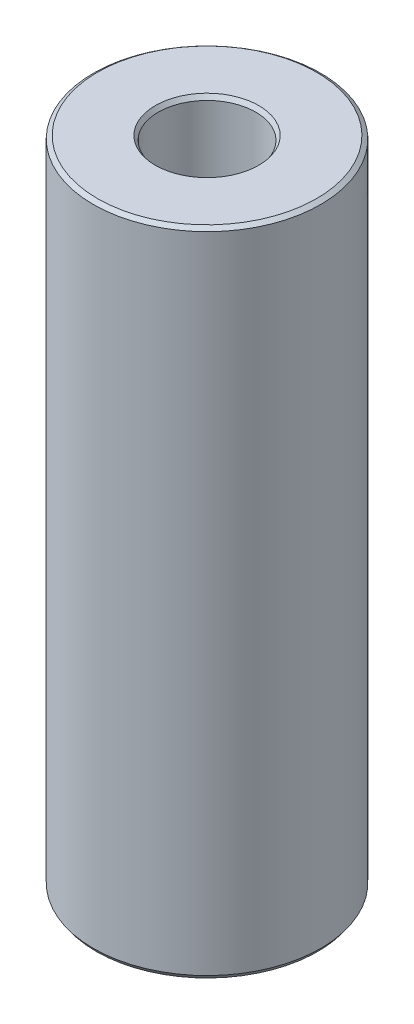
ISO-10303-21;
HEADER;
FILE_DESCRIPTION(('STEP AP214'),'2;1');
FILE_NAME('part.step','',(''),(''),'','','');
FILE_SCHEMA(('AUTOMOTIVE_DESIGN { 1 0 10303 214 1 1 1 1 }'));
ENDSEC;
DATA;
#1=APPLICATION_CONTEXT('core data for automotive mechanical design processes');
#2=APPLICATION_PROTOCOL_DEFINITION('international standard','automotive_design',2000,#1);
#3=PRODUCT_CONTEXT('',#1,'mechanical');
#4=PRODUCT('Part','Part','',(#3));
#5=PRODUCT_RELATED_PRODUCT_CATEGORY('part','',(#4));
#6=PRODUCT_DEFINITION_FORMATION('','',#4);
#7=PRODUCT_DEFINITION_CONTEXT('part definition',#1,'design');
#8=PRODUCT_DEFINITION('design','',#6,#7);
#9=PRODUCT_DEFINITION_SHAPE('','',#8);
#10=(LENGTH_UNIT() NAMED_UNIT(*) SI_UNIT(.MILLI.,.METRE.));
#11=(NAMED_UNIT(*) PLANE_ANGLE_UNIT() SI_UNIT($,.RADIAN.));
#12=(NAMED_UNIT(*) SI_UNIT($,.STERADIAN.) SOLID_ANGLE_UNIT());
#13=UNCERTAINTY_MEASURE_WITH_UNIT(LENGTH_MEASURE(1.E-05),#10,'distance_accuracy_value','');
#14=(GEOMETRIC_REPRESENTATION_CONTEXT(3) GLOBAL_UNCERTAINTY_ASSIGNED_CONTEXT((#13)) GLOBAL_UNIT_ASSIGNED_CONTEXT((#10,
#11,#12)) REPRESENTATION_CONTEXT('',''));
#15=CARTESIAN_POINT('',(0.,0.,0.));
#16=DIRECTION('',(0.,0.,1.));
#17=DIRECTION('',(1.,0.,0.));
#18=AXIS2_PLACEMENT_3D('',#15,#16,#17);
#19=CARTESIAN_POINT('',(0.,229.121744929607,0.));
#20=DIRECTION('',(0.,-1.,0.));
#21=DIRECTION('',(0.,0.,-1.));
#22=AXIS2_PLACEMENT_3D('',#19,#20,#21);
#23=CYLINDRICAL_SURFACE('',#22,40.);
#24=CARTESIAN_POINT('',(0.,1.47722546044582,0.));
#25=DIRECTION('',(0.,1.,0.));
#26=DIRECTION('',(0.,0.,1.));
#27=AXIS2_PLACEMENT_3D('',#24,#25,#26);
#28=CIRCLE('',#27,40.);
#29=CARTESIAN_POINT('',(0.,1.47722546044582,40.));
#30=VERTEX_POINT('',#29);
#31=EDGE_CURVE('E10',#30,#30,#28,.T.);
#32=ORIENTED_EDGE('',*,*,#31,.T.);
#33=EDGE_LOOP('',(#32));
#34=FACE_BOUND('',#33,.T.);
#35=CARTESIAN_POINT('',(0.,228.077412357886,0.));
#36=DIRECTION('',(0.,1.,0.));
#37=DIRECTION('',(0.,0.,1.));
#38=AXIS2_PLACEMENT_3D('',#35,#36,#37);
#39=CIRCLE('',#38,40.);
#40=CARTESIAN_POINT('',(0.,228.077412357886,40.));
#41=VERTEX_POINT('',#40);
#42=EDGE_CURVE('E50',#41,#41,#39,.F.);
#43=ORIENTED_EDGE('',*,*,#42,.T.);
#44=EDGE_LOOP('',(#43));
#45=FACE_BOUND('',#44,.T.);
#46=ADVANCED_FACE('F39',(#34,#45),#23,.T.);
#47=CARTESIAN_POINT('',(0.,229.121744929607,0.));
#48=DIRECTION('',(0.,1.,0.));
#49=DIRECTION('',(0.,0.,1.));
#50=AXIS2_PLACEMENT_3D('',#47,#48,#49);
#51=PLANE('',#50);
#52=CARTESIAN_POINT('',(0.,229.121744929607,0.));
#53=DIRECTION('',(0.,1.,0.));
#54=DIRECTION('',(0.,0.,1.));
#55=AXIS2_PLACEMENT_3D('',#52,#53,#54);
#56=CIRCLE('',#55,18.2015370441067);
#57=CARTESIAN_POINT('',(0.,229.121744929607,18.2015370441067));
#58=VERTEX_POINT('',#57);
#59=EDGE_CURVE('E58',#58,#58,#56,.F.);
#60=ORIENTED_EDGE('',*,*,#59,.T.);
#61=EDGE_LOOP('',(#60));
#62=FACE_BOUND('',#61,.T.);
#63=CARTESIAN_POINT('',(0.,229.121744929607,0.));
#64=DIRECTION('',(0.,1.,0.));
#65=DIRECTION('',(0.,0.,1.));
#66=AXIS2_PLACEMENT_3D('',#63,#64,#65);
#67=CIRCLE('',#66,38.5227745395542);
#68=CARTESIAN_POINT('',(0.,229.121744929607,38.5227745395542));
#69=VERTEX_POINT('',#68);
#70=EDGE_CURVE('E61',#69,#69,#67,.T.);
#71=ORIENTED_EDGE('',*,*,#70,.T.);
#72=EDGE_LOOP('',(#71));
#73=FACE_BOUND('',#72,.T.);
#74=ADVANCED_FACE('F88',(#62,#73),#51,.T.);
#75=CARTESIAN_POINT('',(0.,0.,0.));
#76=DIRECTION('',(0.,1.,0.));
#77=DIRECTION('',(0.,0.,1.));
#78=AXIS2_PLACEMENT_3D('',#75,#76,#77);
#79=PLANE('',#78);
#80=CARTESIAN_POINT('',(0.,0.,0.));
#81=DIRECTION('',(0.,1.,0.));
#82=DIRECTION('',(0.,0.,1.));
#83=AXIS2_PLACEMENT_3D('',#80,#81,#82);
#84=CIRCLE('',#83,18.6344299328314);
#85=CARTESIAN_POINT('',(0.,0.,18.6344299328314));
#86=VERTEX_POINT('',#85);
#87=EDGE_CURVE('E51',#86,#86,#84,.T.);
#88=ORIENTED_EDGE('',*,*,#87,.T.);
#89=EDGE_LOOP('',(#88));
#90=FACE_BOUND('',#89,.T.);
#91=CARTESIAN_POINT('',(0.,0.,0.));
#92=DIRECTION('',(0.,1.,0.));
#93=DIRECTION('',(0.,0.,1.));
#94=AXIS2_PLACEMENT_3D('',#91,#92,#93);
#95=CIRCLE('',#94,38.9556674282788);
#96=CARTESIAN_POINT('',(0.,0.,38.9556674282788));
#97=VERTEX_POINT('',#96);
#98=EDGE_CURVE('E54',#97,#97,#95,.F.);
#99=ORIENTED_EDGE('',*,*,#98,.T.);
#100=EDGE_LOOP('',(#99));
#101=FACE_BOUND('',#100,.T.);
#102=ADVANCED_FACE('F83',(#90,#101),#79,.F.);
#103=CARTESIAN_POINT('',(0.,229.121744929607,0.));
#104=DIRECTION('',(0.,-1.,0.));
#105=DIRECTION('',(0.,0.,-1.));
#106=AXIS2_PLACEMENT_3D('',#103,#104,#105);
#107=CYLINDRICAL_SURFACE('',#106,17.1572044723856);
#108=CARTESIAN_POINT('',(0.,227.644519469162,0.));
#109=DIRECTION('',(0.,1.,0.));
#110=DIRECTION('',(0.,0.,1.));
#111=AXIS2_PLACEMENT_3D('',#108,#109,#110);
#112=CIRCLE('',#111,17.1572044723856);
#113=CARTESIAN_POINT('',(0.,227.644519469162,17.1572044723856));
#114=VERTEX_POINT('',#113);
#115=EDGE_CURVE('E67',#114,#114,#112,.T.);
#116=ORIENTED_EDGE('',*,*,#115,.T.);
#117=EDGE_LOOP('',(#116));
#118=FACE_BOUND('',#117,.T.);
#119=CARTESIAN_POINT('',(0.,1.04433257172123,0.));
#120=DIRECTION('',(0.,1.,0.));
#121=DIRECTION('',(0.,0.,1.));
#122=AXIS2_PLACEMENT_3D('',#119,#120,#121);
#123=CIRCLE('',#122,17.1572044723856);
#124=CARTESIAN_POINT('',(0.,1.04433257172123,17.1572044723856));
#125=VERTEX_POINT('',#124);
#126=EDGE_CURVE('E69',#125,#125,#123,.F.);
#127=ORIENTED_EDGE('',*,*,#126,.T.);
#128=EDGE_LOOP('',(#127));
#129=FACE_BOUND('',#128,.T.);
#130=ADVANCED_FACE('F71',(#118,#129),#107,.F.);
#131=CARTESIAN_POINT('',(0.,227.644519469162,0.));
#132=DIRECTION('',(0.,1.,0.));
#133=DIRECTION('',(0.,0.,1.));
#134=AXIS2_PLACEMENT_3D('',#131,#132,#133);
#135=CONICAL_SURFACE('',#134,17.1572044723856,0.615378805701456);
#136=ORIENTED_EDGE('',*,*,#59,.F.);
#137=EDGE_LOOP('',(#136));
#138=FACE_BOUND('',#137,.T.);
#139=ORIENTED_EDGE('',*,*,#115,.F.);
#140=EDGE_LOOP('',(#139));
#141=FACE_BOUND('',#140,.T.);
#142=ADVANCED_FACE('F77',(#138,#141),#135,.F.);
#143=CARTESIAN_POINT('',(0.,0.,0.));
#144=DIRECTION('',(0.,-1.,0.));
#145=DIRECTION('',(0.,0.,-1.));
#146=AXIS2_PLACEMENT_3D('',#143,#144,#145);
#147=CONICAL_SURFACE('',#146,18.6344299328314,0.955417521093437);
#148=ORIENTED_EDGE('',*,*,#126,.F.);
#149=EDGE_LOOP('',(#148));
#150=FACE_BOUND('',#149,.T.);
#151=ORIENTED_EDGE('',*,*,#87,.F.);
#152=EDGE_LOOP('',(#151));
#153=FACE_BOUND('',#152,.T.);
#154=ADVANCED_FACE('F73',(#150,#153),#147,.F.);
#155=CARTESIAN_POINT('',(0.,1.47722546044582,0.));
#156=DIRECTION('',(0.,1.,0.));
#157=DIRECTION('',(0.,0.,1.));
#158=AXIS2_PLACEMENT_3D('',#155,#156,#157);
#159=CONICAL_SURFACE('',#158,40.,0.61537880570146);
#160=ORIENTED_EDGE('',*,*,#98,.F.);
#161=EDGE_LOOP('',(#160));
#162=FACE_BOUND('',#161,.T.);
#163=ORIENTED_EDGE('',*,*,#31,.F.);
#164=EDGE_LOOP('',(#163));
#165=FACE_BOUND('',#164,.T.);
#166=ADVANCED_FACE('F76',(#162,#165),#159,.T.);
#167=CARTESIAN_POINT('',(0.,229.121744929607,0.));
#168=DIRECTION('',(0.,-1.,0.));
#169=DIRECTION('',(0.,0.,-1.));
#170=AXIS2_PLACEMENT_3D('',#167,#168,#169);
#171=CONICAL_SURFACE('',#170,38.5227745395542,0.955417521093419);
#172=ORIENTED_EDGE('',*,*,#42,.F.);
#173=EDGE_LOOP('',(#172));
#174=FACE_BOUND('',#173,.T.);
#175=ORIENTED_EDGE('',*,*,#70,.F.);
#176=EDGE_LOOP('',(#175));
#177=FACE_BOUND('',#176,.T.);
#178=ADVANCED_FACE('F45',(#174,#177),#171,.T.);
#179=CLOSED_SHELL('',(#46,#74,#102,#130,#142,#154,#166,#178));
#180=MANIFOLD_SOLID_BREP('B2',#179);
#181=ADVANCED_BREP_SHAPE_REPRESENTATION('',(#18,#180),#14);
#182=SHAPE_DEFINITION_REPRESENTATION(#9,#181);
ENDSEC;
END-ISO-10303-21;
